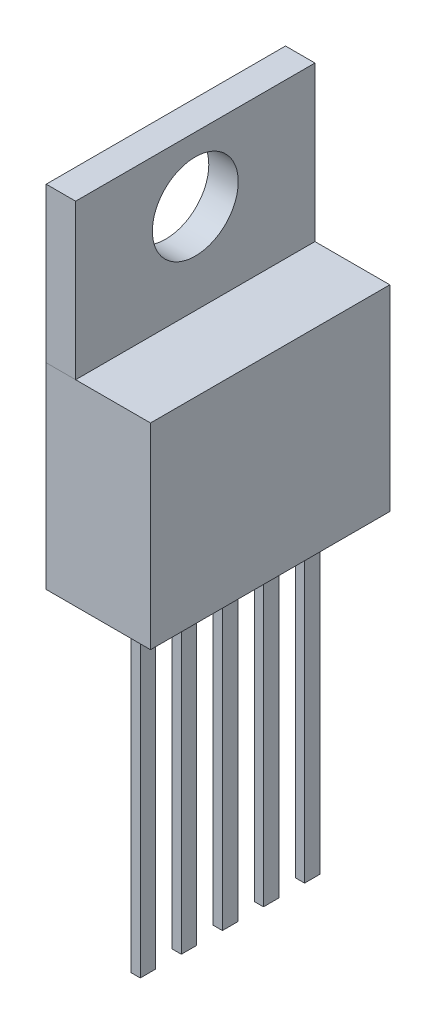
ISO-10303-21;
HEADER;
FILE_DESCRIPTION(('STEP AP214'),'2;1');
FILE_NAME('part.step','',(''),(''),'','','');
FILE_SCHEMA(('AUTOMOTIVE_DESIGN { 1 0 10303 214 1 1 1 1 }'));
ENDSEC;
DATA;
#1=APPLICATION_CONTEXT('core data for automotive mechanical design processes');
#2=APPLICATION_PROTOCOL_DEFINITION('international standard','automotive_design',2000,#1);
#3=PRODUCT_CONTEXT('',#1,'mechanical');
#4=PRODUCT('Part','Part','',(#3));
#5=PRODUCT_RELATED_PRODUCT_CATEGORY('part','',(#4));
#6=PRODUCT_DEFINITION_FORMATION('','',#4);
#7=PRODUCT_DEFINITION_CONTEXT('part definition',#1,'design');
#8=PRODUCT_DEFINITION('design','',#6,#7);
#9=PRODUCT_DEFINITION_SHAPE('','',#8);
#10=(LENGTH_UNIT() NAMED_UNIT(*) SI_UNIT(.MILLI.,.METRE.));
#11=(NAMED_UNIT(*) PLANE_ANGLE_UNIT() SI_UNIT($,.RADIAN.));
#12=(NAMED_UNIT(*) SI_UNIT($,.STERADIAN.) SOLID_ANGLE_UNIT());
#13=UNCERTAINTY_MEASURE_WITH_UNIT(LENGTH_MEASURE(1.E-05),#10,'distance_accuracy_value','');
#14=(GEOMETRIC_REPRESENTATION_CONTEXT(3) GLOBAL_UNCERTAINTY_ASSIGNED_CONTEXT((#13)) GLOBAL_UNIT_ASSIGNED_CONTEXT((#10,
#11,#12)) REPRESENTATION_CONTEXT('',''));
#15=CARTESIAN_POINT('',(0.,0.,0.));
#16=DIRECTION('',(0.,0.,1.));
#17=DIRECTION('',(1.,0.,0.));
#18=AXIS2_PLACEMENT_3D('',#15,#16,#17);
#19=CARTESIAN_POINT('',(4.318,4.064,-4.953));
#20=DIRECTION('',(0.,0.,1.));
#21=DIRECTION('',(0.,-1.,0.));
#22=AXIS2_PLACEMENT_3D('',#19,#20,#21);
#23=PLANE('',#22);
#24=DIRECTION('',(1.,0.,0.));
#25=VECTOR('',#24,1.);
#26=CARTESIAN_POINT('',(4.318,4.064,-4.953));
#27=LINE('',#26,#25);
#28=CARTESIAN_POINT('',(0.,4.064,-4.953));
#29=VERTEX_POINT('',#28);
#30=CARTESIAN_POINT('',(1.219,4.064,-4.953));
#31=VERTEX_POINT('',#30);
#32=EDGE_CURVE('E11',#29,#31,#27,.T.);
#33=ORIENTED_EDGE('',*,*,#32,.F.);
#34=DIRECTION('',(0.,1.,0.));
#35=VECTOR('',#34,1.);
#36=CARTESIAN_POINT('',(0.,4.064,-4.953));
#37=LINE('',#36,#35);
#38=CARTESIAN_POINT('',(0.,10.465,-4.953));
#39=VERTEX_POINT('',#38);
#40=EDGE_CURVE('E471',#29,#39,#37,.T.);
#41=ORIENTED_EDGE('',*,*,#40,.T.);
#42=DIRECTION('',(-1.,0.,0.));
#43=VECTOR('',#42,1.);
#44=CARTESIAN_POINT('',(1.219,10.465,-4.953));
#45=LINE('',#44,#43);
#46=CARTESIAN_POINT('',(1.219,10.465,-4.953));
#47=VERTEX_POINT('',#46);
#48=EDGE_CURVE('E467',#47,#39,#45,.T.);
#49=ORIENTED_EDGE('',*,*,#48,.F.);
#50=DIRECTION('',(0.,1.,0.));
#51=VECTOR('',#50,1.);
#52=CARTESIAN_POINT('',(1.219,4.064,-4.953));
#53=LINE('',#52,#51);
#54=EDGE_CURVE('E450',#31,#47,#53,.T.);
#55=ORIENTED_EDGE('',*,*,#54,.F.);
#56=EDGE_LOOP('',(#33,#41,#49,#55));
#57=FACE_BOUND('',#56,.T.);
#58=ADVANCED_FACE('F43',(#57),#23,.F.);
#59=CARTESIAN_POINT('',(0.,0.,0.));
#60=DIRECTION('',(1.,0.,0.));
#61=DIRECTION('',(0.,0.,-1.));
#62=AXIS2_PLACEMENT_3D('',#59,#60,#61);
#63=PLANE('',#62);
#64=CARTESIAN_POINT('',(0.,7.798,0.));
#65=DIRECTION('',(1.,0.,0.));
#66=DIRECTION('',(0.,0.,-1.));
#67=AXIS2_PLACEMENT_3D('',#64,#65,#66);
#68=CIRCLE('',#67,1.778);
#69=CARTESIAN_POINT('',(0.,7.798,-1.778));
#70=VERTEX_POINT('',#69);
#71=EDGE_CURVE('E437',#70,#70,#68,.T.);
#72=ORIENTED_EDGE('',*,*,#71,.T.);
#73=EDGE_LOOP('',(#72));
#74=FACE_BOUND('',#73,.T.);
#75=DIRECTION('',(0.,0.,-1.));
#76=VECTOR('',#75,1.);
#77=CARTESIAN_POINT('',(0.,4.064,0.));
#78=LINE('',#77,#76);
#79=CARTESIAN_POINT('',(0.,4.064,4.953));
#80=VERTEX_POINT('',#79);
#81=EDGE_CURVE('E52',#80,#29,#78,.T.);
#82=ORIENTED_EDGE('',*,*,#81,.F.);
#83=DIRECTION('',(0.,-1.,0.));
#84=VECTOR('',#83,1.);
#85=CARTESIAN_POINT('',(0.,4.064,4.953));
#86=LINE('',#85,#84);
#87=CARTESIAN_POINT('',(0.,10.465,4.953));
#88=VERTEX_POINT('',#87);
#89=EDGE_CURVE('E492',#88,#80,#86,.T.);
#90=ORIENTED_EDGE('',*,*,#89,.F.);
#91=DIRECTION('',(0.,0.,1.));
#92=VECTOR('',#91,1.);
#93=CARTESIAN_POINT('',(0.,10.465,-4.953));
#94=LINE('',#93,#92);
#95=EDGE_CURVE('E442',#39,#88,#94,.T.);
#96=ORIENTED_EDGE('',*,*,#95,.F.);
#97=ORIENTED_EDGE('',*,*,#40,.F.);
#98=EDGE_LOOP('',(#82,#90,#96,#97));
#99=FACE_BOUND('',#98,.T.);
#100=ADVANCED_FACE('F523',(#74,#99),#63,.F.);
#101=CARTESIAN_POINT('',(4.318,4.064,4.953));
#102=DIRECTION('',(0.,0.,-1.));
#103=DIRECTION('',(-1.,0.,0.));
#104=AXIS2_PLACEMENT_3D('',#101,#102,#103);
#105=PLANE('',#104);
#106=DIRECTION('',(-1.,0.,0.));
#107=VECTOR('',#106,1.);
#108=CARTESIAN_POINT('',(4.318,4.064,4.953));
#109=LINE('',#108,#107);
#110=CARTESIAN_POINT('',(1.219,4.064,4.953));
#111=VERTEX_POINT('',#110);
#112=EDGE_CURVE('E513',#111,#80,#109,.T.);
#113=ORIENTED_EDGE('',*,*,#112,.F.);
#114=DIRECTION('',(0.,-1.,0.));
#115=VECTOR('',#114,1.);
#116=CARTESIAN_POINT('',(1.219,10.465,4.953));
#117=LINE('',#116,#115);
#118=CARTESIAN_POINT('',(1.219,10.465,4.953));
#119=VERTEX_POINT('',#118);
#120=EDGE_CURVE('E456',#119,#111,#117,.T.);
#121=ORIENTED_EDGE('',*,*,#120,.F.);
#122=DIRECTION('',(-1.,0.,0.));
#123=VECTOR('',#122,1.);
#124=CARTESIAN_POINT('',(1.219,10.465,4.953));
#125=LINE('',#124,#123);
#126=EDGE_CURVE('E460',#119,#88,#125,.T.);
#127=ORIENTED_EDGE('',*,*,#126,.T.);
#128=ORIENTED_EDGE('',*,*,#89,.T.);
#129=EDGE_LOOP('',(#113,#121,#127,#128));
#130=FACE_BOUND('',#129,.T.);
#131=ADVANCED_FACE('F551',(#130),#105,.F.);
#132=CARTESIAN_POINT('',(4.318,-4.064,4.953));
#133=DIRECTION('',(0.,1.,0.));
#134=DIRECTION('',(0.,0.,1.));
#135=AXIS2_PLACEMENT_3D('',#132,#133,#134);
#136=PLANE('',#135);
#137=DIRECTION('',(1.,0.,0.));
#138=VECTOR('',#137,1.);
#139=CARTESIAN_POINT('',(2.59099999999996,-4.064,3.01431643785919));
#140=LINE('',#139,#138);
#141=CARTESIAN_POINT('',(2.20999999999996,-4.064,3.01431643785919));
#142=VERTEX_POINT('',#141);
#143=CARTESIAN_POINT('',(2.59099999999996,-4.064,3.01431643785919));
#144=VERTEX_POINT('',#143);
#145=EDGE_CURVE('E247',#142,#144,#140,.T.);
#146=ORIENTED_EDGE('',*,*,#145,.F.);
#147=DIRECTION('',(0.,0.,-1.));
#148=VECTOR('',#147,1.);
#149=CARTESIAN_POINT('',(2.20999999999996,-4.064,3.33181643785919));
#150=LINE('',#149,#148);
#151=CARTESIAN_POINT('',(2.20999999999996,-4.064,3.64931643785919));
#152=VERTEX_POINT('',#151);
#153=EDGE_CURVE('E263',#152,#142,#150,.T.);
#154=ORIENTED_EDGE('',*,*,#153,.F.);
#155=DIRECTION('',(-1.,0.,0.));
#156=VECTOR('',#155,1.);
#157=CARTESIAN_POINT('',(2.20999999999996,-4.064,3.64931643785919));
#158=LINE('',#157,#156);
#159=CARTESIAN_POINT('',(2.59099999999996,-4.064,3.64931643785919));
#160=VERTEX_POINT('',#159);
#161=EDGE_CURVE('E277',#160,#152,#158,.T.);
#162=ORIENTED_EDGE('',*,*,#161,.F.);
#163=DIRECTION('',(0.,0.,1.));
#164=VECTOR('',#163,1.);
#165=CARTESIAN_POINT('',(2.59099999999996,-4.064,3.64931643785919));
#166=LINE('',#165,#164);
#167=EDGE_CURVE('E252',#144,#160,#166,.T.);
#168=ORIENTED_EDGE('',*,*,#167,.F.);
#169=EDGE_LOOP('',(#146,#154,#162,#168));
#170=FACE_BOUND('',#169,.T.);
#171=DIRECTION('',(1.,0.,0.));
#172=VECTOR('',#171,1.);
#173=CARTESIAN_POINT('',(2.59099999999998,-4.064,1.31431643785919));
#174=LINE('',#173,#172);
#175=CARTESIAN_POINT('',(2.20999999999998,-4.064,1.31431643785919));
#176=VERTEX_POINT('',#175);
#177=CARTESIAN_POINT('',(2.59099999999998,-4.064,1.31431643785919));
#178=VERTEX_POINT('',#177);
#179=EDGE_CURVE('E345',#176,#178,#174,.T.);
#180=ORIENTED_EDGE('',*,*,#179,.F.);
#181=DIRECTION('',(0.,0.,-1.));
#182=VECTOR('',#181,1.);
#183=CARTESIAN_POINT('',(2.20999999999998,-4.064,1.63181643785919));
#184=LINE('',#183,#182);
#185=CARTESIAN_POINT('',(2.20999999999998,-4.064,1.94931643785919));
#186=VERTEX_POINT('',#185);
#187=EDGE_CURVE('E351',#186,#176,#184,.T.);
#188=ORIENTED_EDGE('',*,*,#187,.F.);
#189=DIRECTION('',(-1.,0.,0.));
#190=VECTOR('',#189,1.);
#191=CARTESIAN_POINT('',(2.20999999999998,-4.064,1.94931643785919));
#192=LINE('',#191,#190);
#193=CARTESIAN_POINT('',(2.59099999999998,-4.064,1.94931643785919));
#194=VERTEX_POINT('',#193);
#195=EDGE_CURVE('E369',#194,#186,#192,.T.);
#196=ORIENTED_EDGE('',*,*,#195,.F.);
#197=DIRECTION('',(0.,0.,1.));
#198=VECTOR('',#197,1.);
#199=CARTESIAN_POINT('',(2.59099999999998,-4.064,1.94931643785919));
#200=LINE('',#199,#198);
#201=EDGE_CURVE('E365',#178,#194,#200,.T.);
#202=ORIENTED_EDGE('',*,*,#201,.F.);
#203=EDGE_LOOP('',(#180,#188,#196,#202));
#204=FACE_BOUND('',#203,.T.);
#205=DIRECTION('',(0.,0.,-1.));
#206=VECTOR('',#205,1.);
#207=CARTESIAN_POINT('',(0.,-4.064,4.953));
#208=LINE('',#207,#206);
#209=CARTESIAN_POINT('',(0.,-4.064,4.953));
#210=VERTEX_POINT('',#209);
#211=CARTESIAN_POINT('',(0.,-4.064,-4.953));
#212=VERTEX_POINT('',#211);
#213=EDGE_CURVE('E477',#210,#212,#208,.T.);
#214=ORIENTED_EDGE('',*,*,#213,.T.);
#215=DIRECTION('',(-1.,0.,0.));
#216=VECTOR('',#215,1.);
#217=CARTESIAN_POINT('',(4.318,-4.064,-4.953));
#218=LINE('',#217,#216);
#219=CARTESIAN_POINT('',(4.318,-4.064,-4.953));
#220=VERTEX_POINT('',#219);
#221=EDGE_CURVE('E486',#220,#212,#218,.T.);
#222=ORIENTED_EDGE('',*,*,#221,.F.);
#223=DIRECTION('',(0.,0.,-1.));
#224=VECTOR('',#223,1.);
#225=CARTESIAN_POINT('',(4.318,-4.064,4.953));
#226=LINE('',#225,#224);
#227=CARTESIAN_POINT('',(4.318,-4.064,4.953));
#228=VERTEX_POINT('',#227);
#229=EDGE_CURVE('E483',#228,#220,#226,.T.);
#230=ORIENTED_EDGE('',*,*,#229,.F.);
#231=DIRECTION('',(-1.,0.,0.));
#232=VECTOR('',#231,1.);
#233=CARTESIAN_POINT('',(4.318,-4.064,4.953));
#234=LINE('',#233,#232);
#235=EDGE_CURVE('E501',#228,#210,#234,.T.);
#236=ORIENTED_EDGE('',*,*,#235,.T.);
#237=EDGE_LOOP('',(#214,#222,#230,#236));
#238=FACE_BOUND('',#237,.T.);
#239=DIRECTION('',(1.,0.,0.));
#240=VECTOR('',#239,1.);
#241=CARTESIAN_POINT('',(2.591,-4.064,-0.385683562140807));
#242=LINE('',#241,#240);
#243=CARTESIAN_POINT('',(2.21,-4.064,-0.385683562140807));
#244=VERTEX_POINT('',#243);
#245=CARTESIAN_POINT('',(2.591,-4.064,-0.385683562140807));
#246=VERTEX_POINT('',#245);
#247=EDGE_CURVE('E391',#244,#246,#242,.T.);
#248=ORIENTED_EDGE('',*,*,#247,.F.);
#249=DIRECTION('',(0.,0.,-1.));
#250=VECTOR('',#249,1.);
#251=CARTESIAN_POINT('',(2.21,-4.064,-0.0681835621408073));
#252=LINE('',#251,#250);
#253=CARTESIAN_POINT('',(2.21,-4.064,0.249316437859193));
#254=VERTEX_POINT('',#253);
#255=EDGE_CURVE('E397',#254,#244,#252,.T.);
#256=ORIENTED_EDGE('',*,*,#255,.F.);
#257=DIRECTION('',(-1.,0.,0.));
#258=VECTOR('',#257,1.);
#259=CARTESIAN_POINT('',(2.21,-4.064,0.249316437859193));
#260=LINE('',#259,#258);
#261=CARTESIAN_POINT('',(2.591,-4.064,0.249316437859193));
#262=VERTEX_POINT('',#261);
#263=EDGE_CURVE('E415',#262,#254,#260,.T.);
#264=ORIENTED_EDGE('',*,*,#263,.F.);
#265=DIRECTION('',(0.,0.,1.));
#266=VECTOR('',#265,1.);
#267=CARTESIAN_POINT('',(2.591,-4.064,0.249316437859193));
#268=LINE('',#267,#266);
#269=EDGE_CURVE('E411',#246,#262,#268,.T.);
#270=ORIENTED_EDGE('',*,*,#269,.F.);
#271=EDGE_LOOP('',(#248,#256,#264,#270));
#272=FACE_BOUND('',#271,.T.);
#273=DIRECTION('',(1.,0.,0.));
#274=VECTOR('',#273,1.);
#275=CARTESIAN_POINT('',(2.59100000000001,-4.064,-2.08568356214081));
#276=LINE('',#275,#274);
#277=CARTESIAN_POINT('',(2.21000000000001,-4.064,-2.08568356214081));
#278=VERTEX_POINT('',#277);
#279=CARTESIAN_POINT('',(2.59100000000001,-4.064,-2.08568356214081));
#280=VERTEX_POINT('',#279);
#281=EDGE_CURVE('E299',#278,#280,#276,.T.);
#282=ORIENTED_EDGE('',*,*,#281,.F.);
#283=DIRECTION('',(0.,0.,-1.));
#284=VECTOR('',#283,1.);
#285=CARTESIAN_POINT('',(2.21000000000001,-4.064,-1.76818356214081));
#286=LINE('',#285,#284);
#287=CARTESIAN_POINT('',(2.21000000000001,-4.064,-1.45068356214081));
#288=VERTEX_POINT('',#287);
#289=EDGE_CURVE('E305',#288,#278,#286,.T.);
#290=ORIENTED_EDGE('',*,*,#289,.F.);
#291=DIRECTION('',(-1.,0.,0.));
#292=VECTOR('',#291,1.);
#293=CARTESIAN_POINT('',(2.21000000000001,-4.064,-1.45068356214081));
#294=LINE('',#293,#292);
#295=CARTESIAN_POINT('',(2.59100000000001,-4.064,-1.45068356214081));
#296=VERTEX_POINT('',#295);
#297=EDGE_CURVE('E323',#296,#288,#294,.T.);
#298=ORIENTED_EDGE('',*,*,#297,.F.);
#299=DIRECTION('',(0.,0.,1.));
#300=VECTOR('',#299,1.);
#301=CARTESIAN_POINT('',(2.59100000000001,-4.064,-1.45068356214081));
#302=LINE('',#301,#300);
#303=EDGE_CURVE('E319',#280,#296,#302,.T.);
#304=ORIENTED_EDGE('',*,*,#303,.F.);
#305=EDGE_LOOP('',(#282,#290,#298,#304));
#306=FACE_BOUND('',#305,.T.);
#307=DIRECTION('',(1.,0.,0.));
#308=VECTOR('',#307,1.);
#309=CARTESIAN_POINT('',(2.59100000000001,-4.064,-3.78568356214081));
#310=LINE('',#309,#308);
#311=CARTESIAN_POINT('',(2.21000000000001,-4.064,-3.78568356214081));
#312=VERTEX_POINT('',#311);
#313=CARTESIAN_POINT('',(2.59100000000001,-4.064,-3.78568356214081));
#314=VERTEX_POINT('',#313);
#315=EDGE_CURVE('E983',#312,#314,#310,.T.);
#316=ORIENTED_EDGE('',*,*,#315,.F.);
#317=DIRECTION('',(0.,0.,-1.));
#318=VECTOR('',#317,1.);
#319=CARTESIAN_POINT('',(2.21000000000001,-4.064,-3.46818356214081));
#320=LINE('',#319,#318);
#321=CARTESIAN_POINT('',(2.21000000000001,-4.064,-3.15068356214081));
#322=VERTEX_POINT('',#321);
#323=EDGE_CURVE('E242',#322,#312,#320,.T.);
#324=ORIENTED_EDGE('',*,*,#323,.F.);
#325=DIRECTION('',(-1.,0.,0.));
#326=VECTOR('',#325,1.);
#327=CARTESIAN_POINT('',(2.21000000000001,-4.064,-3.15068356214081));
#328=LINE('',#327,#326);
#329=CARTESIAN_POINT('',(2.59100000000001,-4.064,-3.15068356214081));
#330=VERTEX_POINT('',#329);
#331=EDGE_CURVE('E965',#330,#322,#328,.T.);
#332=ORIENTED_EDGE('',*,*,#331,.F.);
#333=DIRECTION('',(0.,0.,1.));
#334=VECTOR('',#333,1.);
#335=CARTESIAN_POINT('',(2.59100000000001,-4.064,-3.15068356214081));
#336=LINE('',#335,#334);
#337=EDGE_CURVE('E971',#314,#330,#336,.T.);
#338=ORIENTED_EDGE('',*,*,#337,.F.);
#339=EDGE_LOOP('',(#316,#324,#332,#338));
#340=FACE_BOUND('',#339,.T.);
#341=ADVANCED_FACE('F532',(#170,#204,#238,#272,#306,#340),#136,.F.);
#342=CARTESIAN_POINT('',(4.318,4.064,4.953));
#343=DIRECTION('',(0.,-1.,0.));
#344=DIRECTION('',(0.,0.,-1.));
#345=AXIS2_PLACEMENT_3D('',#342,#343,#344);
#346=PLANE('',#345);
#347=DIRECTION('',(0.,0.,-1.));
#348=VECTOR('',#347,1.);
#349=CARTESIAN_POINT('',(1.219,4.064,4.953));
#350=LINE('',#349,#348);
#351=EDGE_CURVE('E446',#111,#31,#350,.T.);
#352=ORIENTED_EDGE('',*,*,#351,.F.);
#353=DIRECTION('',(-1.,0.,0.));
#354=VECTOR('',#353,1.);
#355=CARTESIAN_POINT('',(4.318,4.064,4.953));
#356=LINE('',#355,#354);
#357=CARTESIAN_POINT('',(4.318,4.064,4.953));
#358=VERTEX_POINT('',#357);
#359=EDGE_CURVE('E505',#358,#111,#356,.T.);
#360=ORIENTED_EDGE('',*,*,#359,.F.);
#361=DIRECTION('',(0.,0.,1.));
#362=VECTOR('',#361,1.);
#363=CARTESIAN_POINT('',(4.318,4.064,4.953));
#364=LINE('',#363,#362);
#365=CARTESIAN_POINT('',(4.318,4.064,-4.953));
#366=VERTEX_POINT('',#365);
#367=EDGE_CURVE('E476',#366,#358,#364,.T.);
#368=ORIENTED_EDGE('',*,*,#367,.F.);
#369=DIRECTION('',(-1.,0.,0.));
#370=VECTOR('',#369,1.);
#371=CARTESIAN_POINT('',(4.318,4.064,-4.953));
#372=LINE('',#371,#370);
#373=EDGE_CURVE('E509',#366,#31,#372,.T.);
#374=ORIENTED_EDGE('',*,*,#373,.T.);
#375=EDGE_LOOP('',(#352,#360,#368,#374));
#376=FACE_BOUND('',#375,.T.);
#377=ADVANCED_FACE('F553',(#376),#346,.F.);
#378=EDGE_CURVE('E487',#212,#29,#37,.T.);
#379=ORIENTED_EDGE('',*,*,#378,.T.);
#380=ORIENTED_EDGE('',*,*,#32,.T.);
#381=ORIENTED_EDGE('',*,*,#373,.F.);
#382=DIRECTION('',(0.,1.,0.));
#383=VECTOR('',#382,1.);
#384=CARTESIAN_POINT('',(4.318,4.064,-4.953));
#385=LINE('',#384,#383);
#386=EDGE_CURVE('E472',#220,#366,#385,.T.);
#387=ORIENTED_EDGE('',*,*,#386,.F.);
#388=ORIENTED_EDGE('',*,*,#221,.T.);
#389=EDGE_LOOP('',(#379,#380,#381,#387,#388));
#390=FACE_BOUND('',#389,.T.);
#391=ADVANCED_FACE('F45',(#390),#23,.F.);
#392=ORIENTED_EDGE('',*,*,#359,.T.);
#393=ORIENTED_EDGE('',*,*,#112,.T.);
#394=EDGE_CURVE('E491',#80,#210,#86,.T.);
#395=ORIENTED_EDGE('',*,*,#394,.T.);
#396=ORIENTED_EDGE('',*,*,#235,.F.);
#397=DIRECTION('',(0.,-1.,0.));
#398=VECTOR('',#397,1.);
#399=CARTESIAN_POINT('',(4.318,4.064,4.953));
#400=LINE('',#399,#398);
#401=EDGE_CURVE('E480',#358,#228,#400,.T.);
#402=ORIENTED_EDGE('',*,*,#401,.F.);
#403=EDGE_LOOP('',(#392,#393,#395,#396,#402));
#404=FACE_BOUND('',#403,.T.);
#405=ADVANCED_FACE('F537',(#404),#105,.F.);
#406=CARTESIAN_POINT('',(4.318,0.,0.));
#407=DIRECTION('',(1.,0.,0.));
#408=DIRECTION('',(0.,0.,-1.));
#409=AXIS2_PLACEMENT_3D('',#406,#407,#408);
#410=PLANE('',#409);
#411=ORIENTED_EDGE('',*,*,#386,.T.);
#412=ORIENTED_EDGE('',*,*,#367,.T.);
#413=ORIENTED_EDGE('',*,*,#401,.T.);
#414=ORIENTED_EDGE('',*,*,#229,.T.);
#415=EDGE_LOOP('',(#411,#412,#413,#414));
#416=FACE_BOUND('',#415,.T.);
#417=ADVANCED_FACE('F572',(#416),#410,.T.);
#418=ORIENTED_EDGE('',*,*,#394,.F.);
#419=ORIENTED_EDGE('',*,*,#81,.T.);
#420=ORIENTED_EDGE('',*,*,#378,.F.);
#421=ORIENTED_EDGE('',*,*,#213,.F.);
#422=EDGE_LOOP('',(#418,#419,#420,#421));
#423=FACE_BOUND('',#422,.T.);
#424=ADVANCED_FACE('F520',(#423),#63,.F.);
#425=CARTESIAN_POINT('',(1.219,0.,0.));
#426=DIRECTION('',(1.,0.,0.));
#427=DIRECTION('',(0.,0.,-1.));
#428=AXIS2_PLACEMENT_3D('',#425,#426,#427);
#429=PLANE('',#428);
#430=ORIENTED_EDGE('',*,*,#351,.T.);
#431=ORIENTED_EDGE('',*,*,#54,.T.);
#432=DIRECTION('',(0.,0.,1.));
#433=VECTOR('',#432,1.);
#434=CARTESIAN_POINT('',(1.219,10.465,-4.953));
#435=LINE('',#434,#433);
#436=EDGE_CURVE('E453',#47,#119,#435,.T.);
#437=ORIENTED_EDGE('',*,*,#436,.T.);
#438=ORIENTED_EDGE('',*,*,#120,.T.);
#439=EDGE_LOOP('',(#430,#431,#437,#438));
#440=FACE_BOUND('',#439,.T.);
#441=CARTESIAN_POINT('',(1.219,7.798,0.));
#442=DIRECTION('',(1.,0.,0.));
#443=DIRECTION('',(0.,0.,-1.));
#444=AXIS2_PLACEMENT_3D('',#441,#442,#443);
#445=CIRCLE('',#444,1.778);
#446=CARTESIAN_POINT('',(1.219,7.798,-1.778));
#447=VERTEX_POINT('',#446);
#448=EDGE_CURVE('E438',#447,#447,#445,.T.);
#449=ORIENTED_EDGE('',*,*,#448,.F.);
#450=EDGE_LOOP('',(#449));
#451=FACE_BOUND('',#450,.T.);
#452=ADVANCED_FACE('F555',(#440,#451),#429,.T.);
#453=CARTESIAN_POINT('',(1.219,10.465,-4.953));
#454=DIRECTION('',(0.,-1.,0.));
#455=DIRECTION('',(0.,0.,-1.));
#456=AXIS2_PLACEMENT_3D('',#453,#454,#455);
#457=PLANE('',#456);
#458=ORIENTED_EDGE('',*,*,#95,.T.);
#459=ORIENTED_EDGE('',*,*,#126,.F.);
#460=ORIENTED_EDGE('',*,*,#436,.F.);
#461=ORIENTED_EDGE('',*,*,#48,.T.);
#462=EDGE_LOOP('',(#458,#459,#460,#461));
#463=FACE_BOUND('',#462,.T.);
#464=ADVANCED_FACE('F560',(#463),#457,.F.);
#465=CARTESIAN_POINT('',(1.219,7.798,0.));
#466=DIRECTION('',(-1.,0.,0.));
#467=DIRECTION('',(0.,0.,1.));
#468=AXIS2_PLACEMENT_3D('',#465,#466,#467);
#469=CYLINDRICAL_SURFACE('',#468,1.778);
#470=ORIENTED_EDGE('',*,*,#448,.T.);
#471=EDGE_LOOP('',(#470));
#472=FACE_BOUND('',#471,.T.);
#473=ORIENTED_EDGE('',*,*,#71,.F.);
#474=EDGE_LOOP('',(#473));
#475=FACE_BOUND('',#474,.T.);
#476=ADVANCED_FACE('F586',(#472,#475),#469,.F.);
#477=CARTESIAN_POINT('',(2.591,-17.348,-0.385683562140807));
#478=DIRECTION('',(0.,0.,1.));
#479=DIRECTION('',(1.,0.,0.));
#480=AXIS2_PLACEMENT_3D('',#477,#478,#479);
#481=PLANE('',#480);
#482=ORIENTED_EDGE('',*,*,#247,.T.);
#483=DIRECTION('',(0.,1.,0.));
#484=VECTOR('',#483,1.);
#485=CARTESIAN_POINT('',(2.591,-17.348,-0.385683562140807));
#486=LINE('',#485,#484);
#487=CARTESIAN_POINT('',(2.591,-17.348,-0.385683562140807));
#488=VERTEX_POINT('',#487);
#489=EDGE_CURVE('E429',#488,#246,#486,.T.);
#490=ORIENTED_EDGE('',*,*,#489,.F.);
#491=DIRECTION('',(1.,0.,0.));
#492=VECTOR('',#491,1.);
#493=CARTESIAN_POINT('',(2.591,-17.348,-0.385683562140807));
#494=LINE('',#493,#492);
#495=CARTESIAN_POINT('',(2.21,-17.348,-0.385683562140807));
#496=VERTEX_POINT('',#495);
#497=EDGE_CURVE('E396',#496,#488,#494,.T.);
#498=ORIENTED_EDGE('',*,*,#497,.F.);
#499=DIRECTION('',(0.,1.,0.));
#500=VECTOR('',#499,1.);
#501=CARTESIAN_POINT('',(2.21,-17.348,-0.385683562140807));
#502=LINE('',#501,#500);
#503=EDGE_CURVE('E433',#496,#244,#502,.T.);
#504=ORIENTED_EDGE('',*,*,#503,.T.);
#505=EDGE_LOOP('',(#482,#490,#498,#504));
#506=FACE_BOUND('',#505,.T.);
#507=ADVANCED_FACE('F591',(#506),#481,.F.);
#508=CARTESIAN_POINT('',(2.591,-17.348,0.249316437859193));
#509=DIRECTION('',(-1.,0.,0.));
#510=DIRECTION('',(0.,0.,1.));
#511=AXIS2_PLACEMENT_3D('',#508,#509,#510);
#512=PLANE('',#511);
#513=ORIENTED_EDGE('',*,*,#269,.T.);
#514=DIRECTION('',(0.,1.,0.));
#515=VECTOR('',#514,1.);
#516=CARTESIAN_POINT('',(2.591,-17.348,0.249316437859193));
#517=LINE('',#516,#515);
#518=CARTESIAN_POINT('',(2.591,-17.348,0.249316437859193));
#519=VERTEX_POINT('',#518);
#520=EDGE_CURVE('E425',#519,#262,#517,.T.);
#521=ORIENTED_EDGE('',*,*,#520,.F.);
#522=DIRECTION('',(0.,0.,1.));
#523=VECTOR('',#522,1.);
#524=CARTESIAN_POINT('',(2.591,-17.348,0.249316437859193));
#525=LINE('',#524,#523);
#526=EDGE_CURVE('E400',#488,#519,#525,.T.);
#527=ORIENTED_EDGE('',*,*,#526,.F.);
#528=ORIENTED_EDGE('',*,*,#489,.T.);
#529=EDGE_LOOP('',(#513,#521,#527,#528));
#530=FACE_BOUND('',#529,.T.);
#531=ADVANCED_FACE('F595',(#530),#512,.F.);
#532=CARTESIAN_POINT('',(2.21,-17.348,0.249316437859193));
#533=DIRECTION('',(0.,0.,-1.));
#534=DIRECTION('',(-1.,0.,0.));
#535=AXIS2_PLACEMENT_3D('',#532,#533,#534);
#536=PLANE('',#535);
#537=ORIENTED_EDGE('',*,*,#263,.T.);
#538=DIRECTION('',(0.,1.,0.));
#539=VECTOR('',#538,1.);
#540=CARTESIAN_POINT('',(2.21,-17.348,0.249316437859193));
#541=LINE('',#540,#539);
#542=CARTESIAN_POINT('',(2.21,-17.348,0.249316437859193));
#543=VERTEX_POINT('',#542);
#544=EDGE_CURVE('E407',#543,#254,#541,.T.);
#545=ORIENTED_EDGE('',*,*,#544,.F.);
#546=DIRECTION('',(-1.,0.,0.));
#547=VECTOR('',#546,1.);
#548=CARTESIAN_POINT('',(2.21,-17.348,0.249316437859193));
#549=LINE('',#548,#547);
#550=EDGE_CURVE('E403',#519,#543,#549,.T.);
#551=ORIENTED_EDGE('',*,*,#550,.F.);
#552=ORIENTED_EDGE('',*,*,#520,.T.);
#553=EDGE_LOOP('',(#537,#545,#551,#552));
#554=FACE_BOUND('',#553,.T.);
#555=ADVANCED_FACE('F599',(#554),#536,.F.);
#556=CARTESIAN_POINT('',(2.21,-17.348,-0.0681835621408073));
#557=DIRECTION('',(1.,0.,0.));
#558=DIRECTION('',(0.,0.,-1.));
#559=AXIS2_PLACEMENT_3D('',#556,#557,#558);
#560=PLANE('',#559);
#561=ORIENTED_EDGE('',*,*,#255,.T.);
#562=ORIENTED_EDGE('',*,*,#503,.F.);
#563=DIRECTION('',(0.,0.,-1.));
#564=VECTOR('',#563,1.);
#565=CARTESIAN_POINT('',(2.21,-17.348,-0.385683562140807));
#566=LINE('',#565,#564);
#567=EDGE_CURVE('E392',#543,#496,#566,.T.);
#568=ORIENTED_EDGE('',*,*,#567,.F.);
#569=ORIENTED_EDGE('',*,*,#544,.T.);
#570=EDGE_LOOP('',(#561,#562,#568,#569));
#571=FACE_BOUND('',#570,.T.);
#572=ADVANCED_FACE('F603',(#571),#560,.F.);
#573=CARTESIAN_POINT('',(0.,-17.348,0.));
#574=DIRECTION('',(0.,1.,0.));
#575=DIRECTION('',(0.,0.,1.));
#576=AXIS2_PLACEMENT_3D('',#573,#574,#575);
#577=PLANE('',#576);
#578=ORIENTED_EDGE('',*,*,#567,.T.);
#579=ORIENTED_EDGE('',*,*,#497,.T.);
#580=ORIENTED_EDGE('',*,*,#526,.T.);
#581=ORIENTED_EDGE('',*,*,#550,.T.);
#582=EDGE_LOOP('',(#578,#579,#580,#581));
#583=FACE_BOUND('',#582,.T.);
#584=ADVANCED_FACE('F607',(#583),#577,.F.);
#585=CARTESIAN_POINT('',(2.59099999999998,-17.348,1.31431643785919));
#586=DIRECTION('',(0.,0.,1.));
#587=DIRECTION('',(1.,0.,0.));
#588=AXIS2_PLACEMENT_3D('',#585,#586,#587);
#589=PLANE('',#588);
#590=ORIENTED_EDGE('',*,*,#179,.T.);
#591=DIRECTION('',(0.,1.,0.));
#592=VECTOR('',#591,1.);
#593=CARTESIAN_POINT('',(2.59099999999998,-17.348,1.31431643785919));
#594=LINE('',#593,#592);
#595=CARTESIAN_POINT('',(2.59099999999998,-17.348,1.31431643785919));
#596=VERTEX_POINT('',#595);
#597=EDGE_CURVE('E383',#596,#178,#594,.T.);
#598=ORIENTED_EDGE('',*,*,#597,.F.);
#599=DIRECTION('',(1.,0.,0.));
#600=VECTOR('',#599,1.);
#601=CARTESIAN_POINT('',(2.59099999999998,-17.348,1.31431643785919));
#602=LINE('',#601,#600);
#603=CARTESIAN_POINT('',(2.20999999999998,-17.348,1.31431643785919));
#604=VERTEX_POINT('',#603);
#605=EDGE_CURVE('E350',#604,#596,#602,.T.);
#606=ORIENTED_EDGE('',*,*,#605,.F.);
#607=DIRECTION('',(0.,1.,0.));
#608=VECTOR('',#607,1.);
#609=CARTESIAN_POINT('',(2.20999999999998,-17.348,1.31431643785919));
#610=LINE('',#609,#608);
#611=EDGE_CURVE('E387',#604,#176,#610,.T.);
#612=ORIENTED_EDGE('',*,*,#611,.T.);
#613=EDGE_LOOP('',(#590,#598,#606,#612));
#614=FACE_BOUND('',#613,.T.);
#615=ADVANCED_FACE('F611',(#614),#589,.F.);
#616=CARTESIAN_POINT('',(2.59099999999998,-17.348,1.94931643785919));
#617=DIRECTION('',(-1.,0.,0.));
#618=DIRECTION('',(0.,0.,1.));
#619=AXIS2_PLACEMENT_3D('',#616,#617,#618);
#620=PLANE('',#619);
#621=ORIENTED_EDGE('',*,*,#201,.T.);
#622=DIRECTION('',(0.,1.,0.));
#623=VECTOR('',#622,1.);
#624=CARTESIAN_POINT('',(2.59099999999998,-17.348,1.94931643785919));
#625=LINE('',#624,#623);
#626=CARTESIAN_POINT('',(2.59099999999998,-17.348,1.94931643785919));
#627=VERTEX_POINT('',#626);
#628=EDGE_CURVE('E379',#627,#194,#625,.T.);
#629=ORIENTED_EDGE('',*,*,#628,.F.);
#630=DIRECTION('',(0.,0.,1.));
#631=VECTOR('',#630,1.);
#632=CARTESIAN_POINT('',(2.59099999999998,-17.348,1.94931643785919));
#633=LINE('',#632,#631);
#634=EDGE_CURVE('E354',#596,#627,#633,.T.);
#635=ORIENTED_EDGE('',*,*,#634,.F.);
#636=ORIENTED_EDGE('',*,*,#597,.T.);
#637=EDGE_LOOP('',(#621,#629,#635,#636));
#638=FACE_BOUND('',#637,.T.);
#639=ADVANCED_FACE('F615',(#638),#620,.F.);
#640=CARTESIAN_POINT('',(2.20999999999998,-17.348,1.94931643785919));
#641=DIRECTION('',(0.,0.,-1.));
#642=DIRECTION('',(-1.,0.,0.));
#643=AXIS2_PLACEMENT_3D('',#640,#641,#642);
#644=PLANE('',#643);
#645=ORIENTED_EDGE('',*,*,#195,.T.);
#646=DIRECTION('',(0.,1.,0.));
#647=VECTOR('',#646,1.);
#648=CARTESIAN_POINT('',(2.20999999999998,-17.348,1.94931643785919));
#649=LINE('',#648,#647);
#650=CARTESIAN_POINT('',(2.20999999999998,-17.348,1.94931643785919));
#651=VERTEX_POINT('',#650);
#652=EDGE_CURVE('E361',#651,#186,#649,.T.);
#653=ORIENTED_EDGE('',*,*,#652,.F.);
#654=DIRECTION('',(-1.,0.,0.));
#655=VECTOR('',#654,1.);
#656=CARTESIAN_POINT('',(2.20999999999998,-17.348,1.94931643785919));
#657=LINE('',#656,#655);
#658=EDGE_CURVE('E357',#627,#651,#657,.T.);
#659=ORIENTED_EDGE('',*,*,#658,.F.);
#660=ORIENTED_EDGE('',*,*,#628,.T.);
#661=EDGE_LOOP('',(#645,#653,#659,#660));
#662=FACE_BOUND('',#661,.T.);
#663=ADVANCED_FACE('F619',(#662),#644,.F.);
#664=CARTESIAN_POINT('',(2.20999999999998,-17.348,1.63181643785919));
#665=DIRECTION('',(1.,0.,0.));
#666=DIRECTION('',(0.,0.,-1.));
#667=AXIS2_PLACEMENT_3D('',#664,#665,#666);
#668=PLANE('',#667);
#669=ORIENTED_EDGE('',*,*,#187,.T.);
#670=ORIENTED_EDGE('',*,*,#611,.F.);
#671=DIRECTION('',(0.,0.,-1.));
#672=VECTOR('',#671,1.);
#673=CARTESIAN_POINT('',(2.20999999999998,-17.348,1.31431643785919));
#674=LINE('',#673,#672);
#675=EDGE_CURVE('E346',#651,#604,#674,.T.);
#676=ORIENTED_EDGE('',*,*,#675,.F.);
#677=ORIENTED_EDGE('',*,*,#652,.T.);
#678=EDGE_LOOP('',(#669,#670,#676,#677));
#679=FACE_BOUND('',#678,.T.);
#680=ADVANCED_FACE('F623',(#679),#668,.F.);
#681=CARTESIAN_POINT('',(0.,-17.348,0.));
#682=DIRECTION('',(0.,1.,0.));
#683=DIRECTION('',(0.,0.,1.));
#684=AXIS2_PLACEMENT_3D('',#681,#682,#683);
#685=PLANE('',#684);
#686=ORIENTED_EDGE('',*,*,#675,.T.);
#687=ORIENTED_EDGE('',*,*,#605,.T.);
#688=ORIENTED_EDGE('',*,*,#634,.T.);
#689=ORIENTED_EDGE('',*,*,#658,.T.);
#690=EDGE_LOOP('',(#686,#687,#688,#689));
#691=FACE_BOUND('',#690,.T.);
#692=ADVANCED_FACE('F627',(#691),#685,.F.);
#693=CARTESIAN_POINT('',(2.59100000000001,-17.348,-2.08568356214081));
#694=DIRECTION('',(0.,0.,1.));
#695=DIRECTION('',(1.,0.,0.));
#696=AXIS2_PLACEMENT_3D('',#693,#694,#695);
#697=PLANE('',#696);
#698=ORIENTED_EDGE('',*,*,#281,.T.);
#699=DIRECTION('',(0.,1.,0.));
#700=VECTOR('',#699,1.);
#701=CARTESIAN_POINT('',(2.59100000000001,-17.348,-2.08568356214081));
#702=LINE('',#701,#700);
#703=CARTESIAN_POINT('',(2.59100000000001,-17.348,-2.08568356214081));
#704=VERTEX_POINT('',#703);
#705=EDGE_CURVE('E337',#704,#280,#702,.T.);
#706=ORIENTED_EDGE('',*,*,#705,.F.);
#707=DIRECTION('',(1.,0.,0.));
#708=VECTOR('',#707,1.);
#709=CARTESIAN_POINT('',(2.59100000000001,-17.348,-2.08568356214081));
#710=LINE('',#709,#708);
#711=CARTESIAN_POINT('',(2.21000000000001,-17.348,-2.08568356214081));
#712=VERTEX_POINT('',#711);
#713=EDGE_CURVE('E304',#712,#704,#710,.T.);
#714=ORIENTED_EDGE('',*,*,#713,.F.);
#715=DIRECTION('',(0.,1.,0.));
#716=VECTOR('',#715,1.);
#717=CARTESIAN_POINT('',(2.21000000000001,-17.348,-2.08568356214081));
#718=LINE('',#717,#716);
#719=EDGE_CURVE('E341',#712,#278,#718,.T.);
#720=ORIENTED_EDGE('',*,*,#719,.T.);
#721=EDGE_LOOP('',(#698,#706,#714,#720));
#722=FACE_BOUND('',#721,.T.);
#723=ADVANCED_FACE('F631',(#722),#697,.F.);
#724=CARTESIAN_POINT('',(2.59100000000001,-17.348,-1.45068356214081));
#725=DIRECTION('',(-1.,0.,0.));
#726=DIRECTION('',(0.,0.,1.));
#727=AXIS2_PLACEMENT_3D('',#724,#725,#726);
#728=PLANE('',#727);
#729=ORIENTED_EDGE('',*,*,#303,.T.);
#730=DIRECTION('',(0.,1.,0.));
#731=VECTOR('',#730,1.);
#732=CARTESIAN_POINT('',(2.59100000000001,-17.348,-1.45068356214081));
#733=LINE('',#732,#731);
#734=CARTESIAN_POINT('',(2.59100000000001,-17.348,-1.45068356214081));
#735=VERTEX_POINT('',#734);
#736=EDGE_CURVE('E333',#735,#296,#733,.T.);
#737=ORIENTED_EDGE('',*,*,#736,.F.);
#738=DIRECTION('',(0.,0.,1.));
#739=VECTOR('',#738,1.);
#740=CARTESIAN_POINT('',(2.59100000000001,-17.348,-1.45068356214081));
#741=LINE('',#740,#739);
#742=EDGE_CURVE('E308',#704,#735,#741,.T.);
#743=ORIENTED_EDGE('',*,*,#742,.F.);
#744=ORIENTED_EDGE('',*,*,#705,.T.);
#745=EDGE_LOOP('',(#729,#737,#743,#744));
#746=FACE_BOUND('',#745,.T.);
#747=ADVANCED_FACE('F635',(#746),#728,.F.);
#748=CARTESIAN_POINT('',(2.21000000000001,-17.348,-1.45068356214081));
#749=DIRECTION('',(0.,0.,-1.));
#750=DIRECTION('',(-1.,0.,0.));
#751=AXIS2_PLACEMENT_3D('',#748,#749,#750);
#752=PLANE('',#751);
#753=ORIENTED_EDGE('',*,*,#297,.T.);
#754=DIRECTION('',(0.,1.,0.));
#755=VECTOR('',#754,1.);
#756=CARTESIAN_POINT('',(2.21000000000001,-17.348,-1.45068356214081));
#757=LINE('',#756,#755);
#758=CARTESIAN_POINT('',(2.21000000000001,-17.348,-1.45068356214081));
#759=VERTEX_POINT('',#758);
#760=EDGE_CURVE('E315',#759,#288,#757,.T.);
#761=ORIENTED_EDGE('',*,*,#760,.F.);
#762=DIRECTION('',(-1.,0.,0.));
#763=VECTOR('',#762,1.);
#764=CARTESIAN_POINT('',(2.21000000000001,-17.348,-1.45068356214081));
#765=LINE('',#764,#763);
#766=EDGE_CURVE('E311',#735,#759,#765,.T.);
#767=ORIENTED_EDGE('',*,*,#766,.F.);
#768=ORIENTED_EDGE('',*,*,#736,.T.);
#769=EDGE_LOOP('',(#753,#761,#767,#768));
#770=FACE_BOUND('',#769,.T.);
#771=ADVANCED_FACE('F639',(#770),#752,.F.);
#772=CARTESIAN_POINT('',(2.21000000000001,-17.348,-1.76818356214081));
#773=DIRECTION('',(1.,0.,0.));
#774=DIRECTION('',(0.,0.,-1.));
#775=AXIS2_PLACEMENT_3D('',#772,#773,#774);
#776=PLANE('',#775);
#777=ORIENTED_EDGE('',*,*,#289,.T.);
#778=ORIENTED_EDGE('',*,*,#719,.F.);
#779=DIRECTION('',(0.,0.,-1.));
#780=VECTOR('',#779,1.);
#781=CARTESIAN_POINT('',(2.21000000000001,-17.348,-2.08568356214081));
#782=LINE('',#781,#780);
#783=EDGE_CURVE('E300',#759,#712,#782,.T.);
#784=ORIENTED_EDGE('',*,*,#783,.F.);
#785=ORIENTED_EDGE('',*,*,#760,.T.);
#786=EDGE_LOOP('',(#777,#778,#784,#785));
#787=FACE_BOUND('',#786,.T.);
#788=ADVANCED_FACE('F643',(#787),#776,.F.);
#789=CARTESIAN_POINT('',(0.,-17.348,0.));
#790=DIRECTION('',(0.,1.,0.));
#791=DIRECTION('',(0.,0.,1.));
#792=AXIS2_PLACEMENT_3D('',#789,#790,#791);
#793=PLANE('',#792);
#794=ORIENTED_EDGE('',*,*,#783,.T.);
#795=ORIENTED_EDGE('',*,*,#713,.T.);
#796=ORIENTED_EDGE('',*,*,#742,.T.);
#797=ORIENTED_EDGE('',*,*,#766,.T.);
#798=EDGE_LOOP('',(#794,#795,#796,#797));
#799=FACE_BOUND('',#798,.T.);
#800=ADVANCED_FACE('F647',(#799),#793,.F.);
#801=CARTESIAN_POINT('',(2.59099999999996,-17.348,3.01431643785919));
#802=DIRECTION('',(0.,0.,1.));
#803=DIRECTION('',(1.,0.,0.));
#804=AXIS2_PLACEMENT_3D('',#801,#802,#803);
#805=PLANE('',#804);
#806=ORIENTED_EDGE('',*,*,#145,.T.);
#807=DIRECTION('',(0.,1.,0.));
#808=VECTOR('',#807,1.);
#809=CARTESIAN_POINT('',(2.59099999999996,-17.348,3.01431643785919));
#810=LINE('',#809,#808);
#811=CARTESIAN_POINT('',(2.59099999999996,-17.348,3.01431643785919));
#812=VERTEX_POINT('',#811);
#813=EDGE_CURVE('E291',#812,#144,#810,.T.);
#814=ORIENTED_EDGE('',*,*,#813,.F.);
#815=DIRECTION('',(1.,0.,0.));
#816=VECTOR('',#815,1.);
#817=CARTESIAN_POINT('',(2.59099999999996,-17.348,3.01431643785919));
#818=LINE('',#817,#816);
#819=CARTESIAN_POINT('',(2.20999999999996,-17.348,3.01431643785919));
#820=VERTEX_POINT('',#819);
#821=EDGE_CURVE('E262',#820,#812,#818,.T.);
#822=ORIENTED_EDGE('',*,*,#821,.F.);
#823=DIRECTION('',(0.,1.,0.));
#824=VECTOR('',#823,1.);
#825=CARTESIAN_POINT('',(2.20999999999996,-17.348,3.01431643785919));
#826=LINE('',#825,#824);
#827=EDGE_CURVE('E295',#820,#142,#826,.T.);
#828=ORIENTED_EDGE('',*,*,#827,.T.);
#829=EDGE_LOOP('',(#806,#814,#822,#828));
#830=FACE_BOUND('',#829,.T.);
#831=ADVANCED_FACE('F651',(#830),#805,.F.);
#832=CARTESIAN_POINT('',(2.59099999999996,-17.348,3.64931643785919));
#833=DIRECTION('',(-1.,0.,0.));
#834=DIRECTION('',(0.,0.,1.));
#835=AXIS2_PLACEMENT_3D('',#832,#833,#834);
#836=PLANE('',#835);
#837=ORIENTED_EDGE('',*,*,#167,.T.);
#838=DIRECTION('',(0.,1.,0.));
#839=VECTOR('',#838,1.);
#840=CARTESIAN_POINT('',(2.59099999999996,-17.348,3.64931643785919));
#841=LINE('',#840,#839);
#842=CARTESIAN_POINT('',(2.59099999999996,-17.348,3.64931643785919));
#843=VERTEX_POINT('',#842);
#844=EDGE_CURVE('E287',#843,#160,#841,.T.);
#845=ORIENTED_EDGE('',*,*,#844,.F.);
#846=DIRECTION('',(0.,0.,1.));
#847=VECTOR('',#846,1.);
#848=CARTESIAN_POINT('',(2.59099999999996,-17.348,3.64931643785919));
#849=LINE('',#848,#847);
#850=EDGE_CURVE('E266',#812,#843,#849,.T.);
#851=ORIENTED_EDGE('',*,*,#850,.F.);
#852=ORIENTED_EDGE('',*,*,#813,.T.);
#853=EDGE_LOOP('',(#837,#845,#851,#852));
#854=FACE_BOUND('',#853,.T.);
#855=ADVANCED_FACE('F655',(#854),#836,.F.);
#856=CARTESIAN_POINT('',(2.20999999999996,-17.348,3.64931643785919));
#857=DIRECTION('',(0.,0.,-1.));
#858=DIRECTION('',(-1.,0.,0.));
#859=AXIS2_PLACEMENT_3D('',#856,#857,#858);
#860=PLANE('',#859);
#861=ORIENTED_EDGE('',*,*,#161,.T.);
#862=DIRECTION('',(0.,1.,0.));
#863=VECTOR('',#862,1.);
#864=CARTESIAN_POINT('',(2.20999999999996,-17.348,3.64931643785919));
#865=LINE('',#864,#863);
#866=CARTESIAN_POINT('',(2.20999999999996,-17.348,3.64931643785919));
#867=VERTEX_POINT('',#866);
#868=EDGE_CURVE('E272',#867,#152,#865,.T.);
#869=ORIENTED_EDGE('',*,*,#868,.F.);
#870=DIRECTION('',(-1.,0.,0.));
#871=VECTOR('',#870,1.);
#872=CARTESIAN_POINT('',(2.20999999999996,-17.348,3.64931643785919));
#873=LINE('',#872,#871);
#874=EDGE_CURVE('E269',#843,#867,#873,.T.);
#875=ORIENTED_EDGE('',*,*,#874,.F.);
#876=ORIENTED_EDGE('',*,*,#844,.T.);
#877=EDGE_LOOP('',(#861,#869,#875,#876));
#878=FACE_BOUND('',#877,.T.);
#879=ADVANCED_FACE('F659',(#878),#860,.F.);
#880=CARTESIAN_POINT('',(2.20999999999996,-17.348,3.33181643785919));
#881=DIRECTION('',(1.,0.,0.));
#882=DIRECTION('',(0.,0.,-1.));
#883=AXIS2_PLACEMENT_3D('',#880,#881,#882);
#884=PLANE('',#883);
#885=ORIENTED_EDGE('',*,*,#153,.T.);
#886=ORIENTED_EDGE('',*,*,#827,.F.);
#887=DIRECTION('',(0.,0.,-1.));
#888=VECTOR('',#887,1.);
#889=CARTESIAN_POINT('',(2.20999999999996,-17.348,3.01431643785919));
#890=LINE('',#889,#888);
#891=EDGE_CURVE('E258',#867,#820,#890,.T.);
#892=ORIENTED_EDGE('',*,*,#891,.F.);
#893=ORIENTED_EDGE('',*,*,#868,.T.);
#894=EDGE_LOOP('',(#885,#886,#892,#893));
#895=FACE_BOUND('',#894,.T.);
#896=ADVANCED_FACE('F663',(#895),#884,.F.);
#897=CARTESIAN_POINT('',(0.,-17.348,0.));
#898=DIRECTION('',(0.,1.,0.));
#899=DIRECTION('',(0.,0.,1.));
#900=AXIS2_PLACEMENT_3D('',#897,#898,#899);
#901=PLANE('',#900);
#902=ORIENTED_EDGE('',*,*,#891,.T.);
#903=ORIENTED_EDGE('',*,*,#821,.T.);
#904=ORIENTED_EDGE('',*,*,#850,.T.);
#905=ORIENTED_EDGE('',*,*,#874,.T.);
#906=EDGE_LOOP('',(#902,#903,#904,#905));
#907=FACE_BOUND('',#906,.T.);
#908=ADVANCED_FACE('F667',(#907),#901,.F.);
#909=CARTESIAN_POINT('',(2.59100000000001,-17.348,-3.78568356214081));
#910=DIRECTION('',(0.,0.,1.));
#911=DIRECTION('',(1.,0.,0.));
#912=AXIS2_PLACEMENT_3D('',#909,#910,#911);
#913=PLANE('',#912);
#914=ORIENTED_EDGE('',*,*,#315,.T.);
#915=DIRECTION('',(0.,1.,0.));
#916=VECTOR('',#915,1.);
#917=CARTESIAN_POINT('',(2.59100000000001,-17.348,-3.78568356214081));
#918=LINE('',#917,#916);
#919=CARTESIAN_POINT('',(2.59100000000001,-17.348,-3.78568356214081));
#920=VERTEX_POINT('',#919);
#921=EDGE_CURVE('E227',#920,#314,#918,.T.);
#922=ORIENTED_EDGE('',*,*,#921,.F.);
#923=DIRECTION('',(1.,0.,0.));
#924=VECTOR('',#923,1.);
#925=CARTESIAN_POINT('',(2.59100000000001,-17.348,-3.78568356214081));
#926=LINE('',#925,#924);
#927=CARTESIAN_POINT('',(2.21000000000001,-17.348,-3.78568356214081));
#928=VERTEX_POINT('',#927);
#929=EDGE_CURVE('E220',#928,#920,#926,.T.);
#930=ORIENTED_EDGE('',*,*,#929,.F.);
#931=DIRECTION('',(0.,1.,0.));
#932=VECTOR('',#931,1.);
#933=CARTESIAN_POINT('',(2.21000000000001,-17.348,-3.78568356214081));
#934=LINE('',#933,#932);
#935=EDGE_CURVE('E225',#928,#312,#934,.T.);
#936=ORIENTED_EDGE('',*,*,#935,.T.);
#937=EDGE_LOOP('',(#914,#922,#930,#936));
#938=FACE_BOUND('',#937,.T.);
#939=ADVANCED_FACE('F223',(#938),#913,.F.);
#940=CARTESIAN_POINT('',(2.59100000000001,-17.348,-3.15068356214081));
#941=DIRECTION('',(-1.,0.,0.));
#942=DIRECTION('',(0.,0.,1.));
#943=AXIS2_PLACEMENT_3D('',#940,#941,#942);
#944=PLANE('',#943);
#945=ORIENTED_EDGE('',*,*,#337,.T.);
#946=DIRECTION('',(0.,1.,0.));
#947=VECTOR('',#946,1.);
#948=CARTESIAN_POINT('',(2.59100000000001,-17.348,-3.15068356214081));
#949=LINE('',#948,#947);
#950=CARTESIAN_POINT('',(2.59100000000001,-17.348,-3.15068356214081));
#951=VERTEX_POINT('',#950);
#952=EDGE_CURVE('E254',#951,#330,#949,.T.);
#953=ORIENTED_EDGE('',*,*,#952,.F.);
#954=DIRECTION('',(0.,0.,1.));
#955=VECTOR('',#954,1.);
#956=CARTESIAN_POINT('',(2.59100000000001,-17.348,-3.15068356214081));
#957=LINE('',#956,#955);
#958=EDGE_CURVE('E231',#920,#951,#957,.T.);
#959=ORIENTED_EDGE('',*,*,#958,.F.);
#960=ORIENTED_EDGE('',*,*,#921,.T.);
#961=EDGE_LOOP('',(#945,#953,#959,#960));
#962=FACE_BOUND('',#961,.T.);
#963=ADVANCED_FACE('F674',(#962),#944,.F.);
#964=CARTESIAN_POINT('',(2.21000000000001,-17.348,-3.15068356214081));
#965=DIRECTION('',(0.,0.,-1.));
#966=DIRECTION('',(-1.,0.,0.));
#967=AXIS2_PLACEMENT_3D('',#964,#965,#966);
#968=PLANE('',#967);
#969=ORIENTED_EDGE('',*,*,#331,.T.);
#970=DIRECTION('',(0.,1.,0.));
#971=VECTOR('',#970,1.);
#972=CARTESIAN_POINT('',(2.21000000000001,-17.348,-3.15068356214081));
#973=LINE('',#972,#971);
#974=CARTESIAN_POINT('',(2.21000000000001,-17.348,-3.15068356214081));
#975=VERTEX_POINT('',#974);
#976=EDGE_CURVE('E966',#975,#322,#973,.T.);
#977=ORIENTED_EDGE('',*,*,#976,.F.);
#978=DIRECTION('',(-1.,0.,0.));
#979=VECTOR('',#978,1.);
#980=CARTESIAN_POINT('',(2.21000000000001,-17.348,-3.15068356214081));
#981=LINE('',#980,#979);
#982=EDGE_CURVE('E237',#951,#975,#981,.T.);
#983=ORIENTED_EDGE('',*,*,#982,.F.);
#984=ORIENTED_EDGE('',*,*,#952,.T.);
#985=EDGE_LOOP('',(#969,#977,#983,#984));
#986=FACE_BOUND('',#985,.T.);
#987=ADVANCED_FACE('F677',(#986),#968,.F.);
#988=CARTESIAN_POINT('',(2.21000000000001,-17.348,-3.46818356214081));
#989=DIRECTION('',(1.,0.,0.));
#990=DIRECTION('',(0.,0.,-1.));
#991=AXIS2_PLACEMENT_3D('',#988,#989,#990);
#992=PLANE('',#991);
#993=ORIENTED_EDGE('',*,*,#323,.T.);
#994=ORIENTED_EDGE('',*,*,#935,.F.);
#995=DIRECTION('',(0.,0.,-1.));
#996=VECTOR('',#995,1.);
#997=CARTESIAN_POINT('',(2.21000000000001,-17.348,-3.78568356214081));
#998=LINE('',#997,#996);
#999=EDGE_CURVE('E232',#975,#928,#998,.T.);
#1000=ORIENTED_EDGE('',*,*,#999,.F.);
#1001=ORIENTED_EDGE('',*,*,#976,.T.);
#1002=EDGE_LOOP('',(#993,#994,#1000,#1001));
#1003=FACE_BOUND('',#1002,.T.);
#1004=ADVANCED_FACE('F245',(#1003),#992,.F.);
#1005=CARTESIAN_POINT('',(0.,-17.348,0.));
#1006=DIRECTION('',(0.,1.,0.));
#1007=DIRECTION('',(0.,0.,1.));
#1008=AXIS2_PLACEMENT_3D('',#1005,#1006,#1007);
#1009=PLANE('',#1008);
#1010=ORIENTED_EDGE('',*,*,#999,.T.);
#1011=ORIENTED_EDGE('',*,*,#929,.T.);
#1012=ORIENTED_EDGE('',*,*,#958,.T.);
#1013=ORIENTED_EDGE('',*,*,#982,.T.);
#1014=EDGE_LOOP('',(#1010,#1011,#1012,#1013));
#1015=FACE_BOUND('',#1014,.T.);
#1016=ADVANCED_FACE('F235',(#1015),#1009,.F.);
#1017=CLOSED_SHELL('',(#58,#100,#131,#341,#377,#391,#405,#417,#424,#452,#464,#476,#507,#531,
#555,#572,#584,#615,#639,#663,#680,#692,#723,#747,#771,#788,#800,#831,#855,#879,#896,#908,#939,
#963,#987,#1004,#1016));
#1018=MANIFOLD_SOLID_BREP('B2',#1017);
#1019=ADVANCED_BREP_SHAPE_REPRESENTATION('',(#18,#1018),#14);
#1020=SHAPE_DEFINITION_REPRESENTATION(#9,#1019);
ENDSEC;
END-ISO-10303-21;
